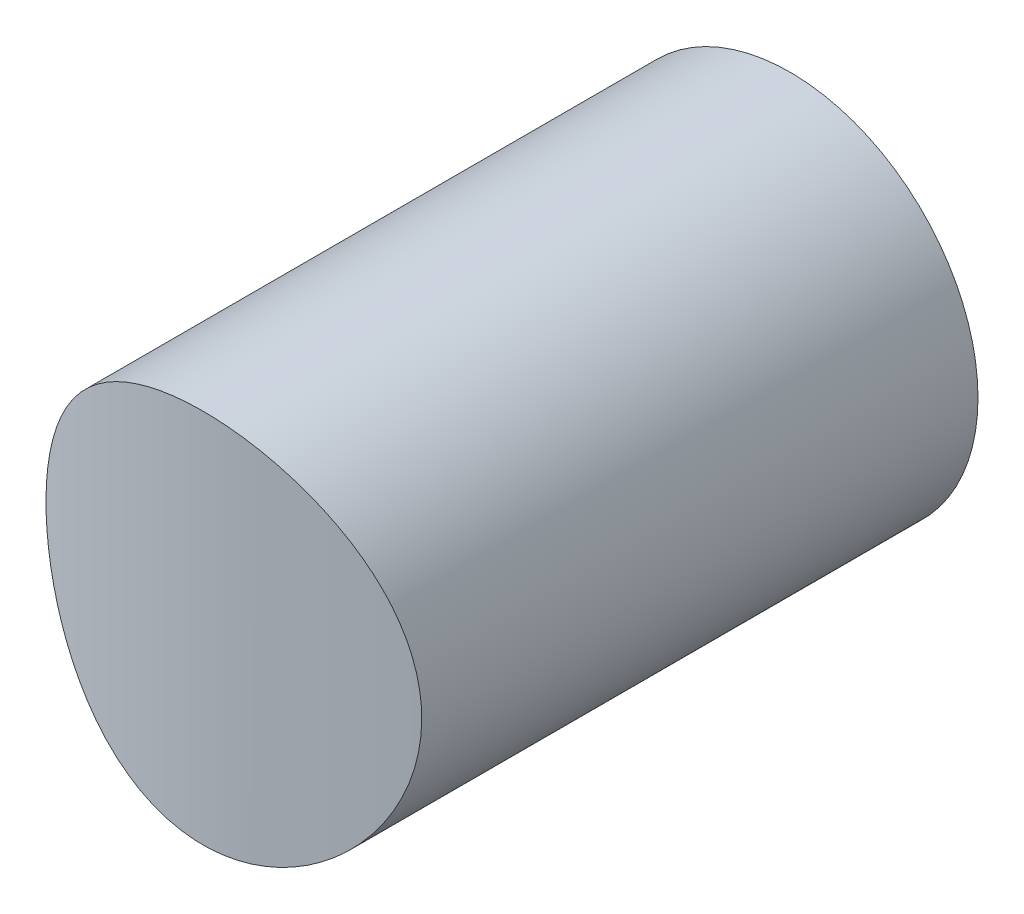
ISO-10303-21;
HEADER;
FILE_DESCRIPTION(('STEP AP214'),'2;1');
FILE_NAME('part.step','',(''),(''),'','','');
FILE_SCHEMA(('AUTOMOTIVE_DESIGN { 1 0 10303 214 1 1 1 1 }'));
ENDSEC;
DATA;
#1=APPLICATION_CONTEXT('core data for automotive mechanical design processes');
#2=APPLICATION_PROTOCOL_DEFINITION('international standard','automotive_design',2000,#1);
#3=PRODUCT_CONTEXT('',#1,'mechanical');
#4=PRODUCT('Part','Part','',(#3));
#5=PRODUCT_RELATED_PRODUCT_CATEGORY('part','',(#4));
#6=PRODUCT_DEFINITION_FORMATION('','',#4);
#7=PRODUCT_DEFINITION_CONTEXT('part definition',#1,'design');
#8=PRODUCT_DEFINITION('design','',#6,#7);
#9=PRODUCT_DEFINITION_SHAPE('','',#8);
#10=(LENGTH_UNIT() NAMED_UNIT(*) SI_UNIT(.MILLI.,.METRE.));
#11=(NAMED_UNIT(*) PLANE_ANGLE_UNIT() SI_UNIT($,.RADIAN.));
#12=(NAMED_UNIT(*) SI_UNIT($,.STERADIAN.) SOLID_ANGLE_UNIT());
#13=UNCERTAINTY_MEASURE_WITH_UNIT(LENGTH_MEASURE(1.E-05),#10,'distance_accuracy_value','');
#14=(GEOMETRIC_REPRESENTATION_CONTEXT(3) GLOBAL_UNCERTAINTY_ASSIGNED_CONTEXT((#13)) GLOBAL_UNIT_ASSIGNED_CONTEXT((#10,
#11,#12)) REPRESENTATION_CONTEXT('',''));
#15=CARTESIAN_POINT('',(0.,0.,0.));
#16=DIRECTION('',(0.,0.,1.));
#17=DIRECTION('',(1.,0.,0.));
#18=AXIS2_PLACEMENT_3D('',#15,#16,#17);
#19=CARTESIAN_POINT('',(0.,50.8,0.));
#20=DIRECTION('',(0.,-1.,0.));
#21=DIRECTION('',(0.,0.,-1.));
#22=AXIS2_PLACEMENT_3D('',#19,#20,#21);
#23=CYLINDRICAL_SURFACE('',#22,50.8);
#24=CARTESIAN_POINT('',(16.256,25.4,48.128811163377));
#25=CARTESIAN_POINT('',(16.2559997151024,24.9561713135289,48.1288113924234));
#26=CARTESIAN_POINT('',(16.2378083851564,24.5123378170694,48.1349670982075));
#27=CARTESIAN_POINT('',(16.1652196336468,23.6279781391114,48.1593929403128));
#28=CARTESIAN_POINT('',(16.1108216671086,23.1874520074956,48.1776632589806));
#29=CARTESIAN_POINT('',(15.9663257320639,22.3128537804768,48.2257423589022));
#30=CARTESIAN_POINT('',(15.8762208590951,21.8787829501547,48.2555533716954));
#31=CARTESIAN_POINT('',(15.661137681709,21.0202575974212,48.3257854897898));
#32=CARTESIAN_POINT('',(15.5361592905212,20.5958030989395,48.3662066214905));
#33=CARTESIAN_POINT('',(15.252677586498,19.7601714121367,48.4563502747829));
#34=CARTESIAN_POINT('',(15.0942377133019,19.3489707726081,48.506055174944));
#35=CARTESIAN_POINT('',(14.7449655711084,18.5416492518996,48.6133658867338));
#36=CARTESIAN_POINT('',(14.5541333511084,18.1455283479107,48.6709716864113));
#37=CARTESIAN_POINT('',(14.1414671210469,17.3707333152569,48.7924702479691));
#38=CARTESIAN_POINT('',(13.9196292208441,16.9920613837742,48.8563637984467));
#39=CARTESIAN_POINT('',(13.4464836416307,16.2544201427049,48.9886967146693));
#40=CARTESIAN_POINT('',(13.1951742480652,15.8954519812042,49.0571363447897));
#41=CARTESIAN_POINT('',(12.656025585119,15.1879099858441,49.1990367231439));
#42=CARTESIAN_POINT('',(12.367260878603,14.8400592689026,49.2725884701456));
#43=CARTESIAN_POINT('',(11.7618838103605,14.1697016186088,49.420594559784));
#44=CARTESIAN_POINT('',(11.445270908385,13.84719517716,49.495048919907));
#45=CARTESIAN_POINT('',(10.7861075376323,13.2294838834434,49.6428641729163));
#46=CARTESIAN_POINT('',(10.4435529308407,12.934283403559,49.7162248891101));
#47=CARTESIAN_POINT('',(9.7346548405273,12.3731671920427,49.8598763156833));
#48=CARTESIAN_POINT('',(9.36831206115078,12.1072505942169,49.9301671168313));
#49=CARTESIAN_POINT('',(8.60504838544576,11.6005258963233,50.0674248360775));
#50=CARTESIAN_POINT('',(8.2076057489821,11.3604703100055,50.1342720695216));
#51=CARTESIAN_POINT('',(7.39274995054897,10.9148202953662,50.2608916688171));
#52=CARTESIAN_POINT('',(6.97533637688993,10.7092265778506,50.3206638887327));
#53=CARTESIAN_POINT('',(6.12350622244352,10.3342536897456,50.4314096522583));
#54=CARTESIAN_POINT('',(5.68909290902608,10.1648676000602,50.4823848765707));
#55=CARTESIAN_POINT('',(4.80634406896904,9.863782955322,50.5740637184857));
#56=CARTESIAN_POINT('',(4.35800908894506,9.73208292264536,50.6147677388022));
#57=CARTESIAN_POINT('',(3.4654579933816,9.51124213396007,50.6835717216323));
#58=CARTESIAN_POINT('',(3.02157558168956,9.42086548680435,50.7120359271693));
#59=CARTESIAN_POINT('',(2.12723666128866,9.27742308705497,50.7574162862327));
#60=CARTESIAN_POINT('',(1.67678028133487,9.2243566047179,50.7743326656208));
#61=CARTESIAN_POINT('',(0.772810571221675,9.15605597249054,50.7961330450653));
#62=CARTESIAN_POINT('',(0.319297887273099,9.14081406213848,50.8010195132951));
#63=CARTESIAN_POINT('',(-0.587377341095775,9.14829118845607,50.7986268119117));
#64=CARTESIAN_POINT('',(-1.04053989271784,9.17100942235279,50.7913478995694));
#65=CARTESIAN_POINT('',(-1.92666147981287,9.25267009305167,50.7653159897355));
#66=CARTESIAN_POINT('',(-2.35975755516148,9.31026998755278,50.7469883538956));
#67=CARTESIAN_POINT('',(-3.2193360568795,9.45999603808497,50.6997154588374));
#68=CARTESIAN_POINT('',(-3.64581867108792,9.55212121163359,50.6707705017557));
#69=CARTESIAN_POINT('',(-4.489279665876,9.77010378670397,50.6030176920961));
#70=CARTESIAN_POINT('',(-4.90625769254133,9.89596244211191,50.5642094728997));
#71=CARTESIAN_POINT('',(-5.72796136129432,10.1803735655269,50.4777292709526));
#72=CARTESIAN_POINT('',(-6.13268674692503,10.3389267173125,50.4300571028218));
#73=CARTESIAN_POINT('',(-6.93232224010545,10.6896824202687,50.3264095173236));
#74=CARTESIAN_POINT('',(-7.32704548251711,10.8822822069853,50.2703374246762));
#75=CARTESIAN_POINT('',(-8.09888086043807,11.2983023471704,50.1517756603534));
#76=CARTESIAN_POINT('',(-8.47599292974113,11.5217228164917,50.0892859645549));
#77=CARTESIAN_POINT('',(-9.21044957367794,11.9978832056653,49.9594509172671));
#78=CARTESIAN_POINT('',(-9.56779011935777,12.2506290690573,49.8921045825065));
#79=CARTESIAN_POINT('',(-10.2605776135252,12.78377415828,49.7542492547535));
#80=CARTESIAN_POINT('',(-10.5960233578008,13.0641749030005,49.683740088165));
#81=CARTESIAN_POINT('',(-11.2572136905938,13.6637139224579,49.5382143373837));
#82=CARTESIAN_POINT('',(-11.5818971069184,13.9840083182676,49.4631352873477));
#83=CARTESIAN_POINT('',(-12.2032811562489,14.6508063906055,49.313508181603));
#84=CARTESIAN_POINT('',(-12.4999809656707,14.99731083798,49.2389601415821));
#85=CARTESIAN_POINT('',(-13.0635069582743,15.7144281828981,49.0924594819785));
#86=CARTESIAN_POINT('',(-13.3303284741291,16.0850448327839,49.0205072690799));
#87=CARTESIAN_POINT('',(-13.8321948579017,16.8480172583977,48.8812665976937));
#88=CARTESIAN_POINT('',(-14.0672410939352,17.2403720971407,48.8139779384731));
#89=CARTESIAN_POINT('',(-14.5065214135615,18.049300004344,48.6852533650305));
#90=CARTESIAN_POINT('',(-14.7103406703151,18.466111707985,48.6238996765513));
#91=CARTESIAN_POINT('',(-15.0819725372181,19.3166605631916,48.5099156183802));
#92=CARTESIAN_POINT('',(-15.2497846702098,19.7503979389621,48.4572853642911));
#93=CARTESIAN_POINT('',(-15.5478545857209,20.6315619244317,48.3624720008551));
#94=CARTESIAN_POINT('',(-15.6781240754762,21.0789842184026,48.3202856352829));
#95=CARTESIAN_POINT('',(-15.8999204282583,21.9842690930481,48.2477582785035));
#96=CARTESIAN_POINT('',(-15.9914491033021,22.4421311843681,48.2174167332859));
#97=CARTESIAN_POINT('',(-16.1318279476175,23.3453247809485,48.1706275584899));
#98=CARTESIAN_POINT('',(-16.1823074904815,23.7903761363014,48.1536504474737));
#99=CARTESIAN_POINT('',(-16.2463670377162,24.6834225944239,48.1320757447049));
#100=CARTESIAN_POINT('',(-16.2599480718506,25.131417614692,48.1274778074745));
#101=CARTESIAN_POINT('',(-16.2500775234547,26.0268836480788,48.1308113721793));
#102=CARTESIAN_POINT('',(-16.2266313927819,26.4743547286345,48.1387410295591));
#103=CARTESIAN_POINT('',(-16.1429491035993,27.3654483058416,48.1668676259481));
#104=CARTESIAN_POINT('',(-16.0827133332653,27.8090708430499,48.1870644355238));
#105=CARTESIAN_POINT('',(-15.9284578203904,28.6755799216243,48.238269009456));
#106=CARTESIAN_POINT('',(-15.8355380295001,29.0986838941455,48.2689239092314));
#107=CARTESIAN_POINT('',(-15.6165071857593,29.93533066604,48.3402312044718));
#108=CARTESIAN_POINT('',(-15.490396979764,30.3488737090681,48.380883344855));
#109=CARTESIAN_POINT('',(-15.20600054186,31.1637974423995,48.4710199879607));
#110=CARTESIAN_POINT('',(-15.0477103338329,31.5651766227033,48.5205055820407));
#111=CARTESIAN_POINT('',(-14.7001701218132,32.3532742156204,48.6269267484012));
#112=CARTESIAN_POINT('',(-14.5109191588362,32.7399921736571,48.6838625514349));
#113=CARTESIAN_POINT('',(-14.0967192063816,33.5077693044692,48.8054346361224));
#114=CARTESIAN_POINT('',(-13.8708753295595,33.8883174246382,48.8702496805616));
#115=CARTESIAN_POINT('',(-13.3893472101938,34.6291996441708,49.0043653484854));
#116=CARTESIAN_POINT('',(-13.1336625175189,34.9895334384915,49.0736660396263));
#117=CARTESIAN_POINT('',(-12.5940448112225,35.6879719285523,49.2149145567029));
#118=CARTESIAN_POINT('',(-12.310105126888,36.026071343543,49.2868630052081));
#119=CARTESIAN_POINT('',(-11.7157663610096,36.6779840628759,49.4315116737751));
#120=CARTESIAN_POINT('',(-11.4053667347477,36.9917968669876,49.5042119092864));
#121=CARTESIAN_POINT('',(-10.7457824992682,37.6064615585056,49.6516592969067));
#122=CARTESIAN_POINT('',(-10.3954942453337,37.9061425199675,49.7263565039625));
#123=CARTESIAN_POINT('',(-9.67029555426186,38.4749877075817,49.8724591502311));
#124=CARTESIAN_POINT('',(-9.29538434472296,38.7441509756967,49.9438644860611));
#125=CARTESIAN_POINT('',(-8.52334691537726,39.2500204639019,50.0813964051691));
#126=CARTESIAN_POINT('',(-8.12622098824203,39.4867271114556,50.1475230579644));
#127=CARTESIAN_POINT('',(-7.31236954850217,39.925858689889,50.2726438520779));
#128=CARTESIAN_POINT('',(-6.89564444114848,40.1282843291969,50.3316381407817));
#129=CARTESIAN_POINT('',(-6.04848523934352,40.4958612891555,50.4404290033421));
#130=CARTESIAN_POINT('',(-5.61817030768499,40.6612684920763,50.4902882567383));
#131=CARTESIAN_POINT('',(-4.74408136368394,40.9551862731826,50.5799038886203));
#132=CARTESIAN_POINT('',(-4.30030734813089,41.0836968425667,50.6196602646961));
#133=CARTESIAN_POINT('',(-3.40272459045617,41.3025888362617,50.6879075630437));
#134=CARTESIAN_POINT('',(-2.94891862547641,41.3929806772401,50.7164015628403));
#135=CARTESIAN_POINT('',(-2.03467140505109,41.534795069135,50.7612995857911));
#136=CARTESIAN_POINT('',(-1.57423040916671,41.586219140269,50.7777040805824));
#137=CARTESIAN_POINT('',(-0.670511061868287,41.6482021567535,50.7974973089933));
#138=CARTESIAN_POINT('',(-0.227359041149252,41.6604440246068,50.8014220137314));
#139=CARTESIAN_POINT('',(0.658406678886367,41.6486984115576,50.7976636019136));
#140=CARTESIAN_POINT('',(1.10102039443263,41.6247120514546,50.78998084446));
#141=CARTESIAN_POINT('',(1.98243339524551,41.540739540152,50.7632185770711));
#142=CARTESIAN_POINT('',(2.42123295319698,41.4807559843291,50.7441398887763));
#143=CARTESIAN_POINT('',(3.29188762303116,41.3253433919072,50.6951042590474));
#144=CARTESIAN_POINT('',(3.72374271249802,41.2299142409183,50.6651472825069));
#145=CARTESIAN_POINT('',(4.5716212603015,41.0060065639227,50.5956396501645));
#146=CARTESIAN_POINT('',(4.98778060009749,40.8779991093648,50.5562261625026));
#147=CARTESIAN_POINT('',(5.80766778240668,40.5893848387421,50.4686138236148));
#148=CARTESIAN_POINT('',(6.21139580101626,40.4287784847032,50.4204150969035));
#149=CARTESIAN_POINT('',(7.00394126073575,40.0761876043953,50.3164444255998));
#150=CARTESIAN_POINT('',(7.39275700551886,39.8841995213313,50.2606716226853));
#151=CARTESIAN_POINT('',(8.15312047669992,39.4702368644591,50.1429423228172));
#152=CARTESIAN_POINT('',(8.52466713184609,39.2482604337146,50.0809854429957));
#153=CARTESIAN_POINT('',(9.2610109221832,38.7675443281604,49.9501588181261));
#154=CARTESIAN_POINT('',(9.6251159611744,38.5077893957156,49.8811229635299));
#155=CARTESIAN_POINT('',(10.3303229133609,37.9595167217031,49.7398610675802));
#156=CARTESIAN_POINT('',(10.6714243415827,37.6709983740483,49.6676349590213));
#157=CARTESIAN_POINT('',(11.3286871627907,37.0669471897174,49.5218558845945));
#158=CARTESIAN_POINT('',(11.6448412135303,36.7514064566565,49.4483025358752));
#159=CARTESIAN_POINT('',(12.2501832886483,36.095315477458,49.3018255858266));
#160=CARTESIAN_POINT('',(12.5393716197317,35.754765515851,49.2289019773433));
#161=CARTESIAN_POINT('',(13.0986895742645,35.0382385036035,49.0831009530922));
#162=CARTESIAN_POINT('',(13.3677861357191,34.661435251389,49.0103160287439));
#163=CARTESIAN_POINT('',(13.8732405334457,33.8855816813223,48.869643442099));
#164=CARTESIAN_POINT('',(14.109597133979,33.486530524541,48.8017559646982));
#165=CARTESIAN_POINT('',(14.5476919641103,32.6689221086521,48.6729575846973));
#166=CARTESIAN_POINT('',(14.7494403252081,32.2503706040189,48.612044642057));
#167=CARTESIAN_POINT('',(15.1167190003797,31.3965228392973,48.4990902866495));
#168=CARTESIAN_POINT('',(15.2822519462237,30.9612277986647,48.4470482292967));
#169=CARTESIAN_POINT('',(15.5651798728285,30.1084941877648,48.3568570163709));
#170=CARTESIAN_POINT('',(15.685162129302,29.6919891651628,48.317982771007));
#171=CARTESIAN_POINT('',(15.8916107257509,28.8499459975329,48.2504769664395));
#172=CARTESIAN_POINT('',(15.9780789562082,28.4244083634514,48.2218448294992));
#173=CARTESIAN_POINT('',(16.1167253158915,27.5672852664731,48.1756838666734));
#174=CARTESIAN_POINT('',(16.1689115054348,27.1357012495785,48.1581524308508));
#175=CARTESIAN_POINT('',(16.2385494154985,26.269413077715,48.1347158236099));
#176=CARTESIAN_POINT('',(16.2560002790435,25.834708846031,48.128810939037));
#177=CARTESIAN_POINT('',(16.256,25.4,48.128811163377));
#178=B_SPLINE_CURVE_WITH_KNOTS('',3,(#24,#25,#26,#27,#28,#29,#30,#31,#32,#33,#34,#35,#36,#37,
#38,#39,#40,#41,#42,#43,#44,#45,#46,#47,#48,#49,#50,#51,#52,#53,#54,#55,#56,#57,#58,#59,#60,#61,
#62,#63,#64,#65,#66,#67,#68,#69,#70,#71,#72,#73,#74,#75,#76,#77,#78,#79,#80,#81,#82,#83,#84,#85,
#86,#87,#88,#89,#90,#91,#92,#93,#94,#95,#96,#97,#98,#99,#100,#101,#102,#103,#104,#105,#106,#107,
#108,#109,#110,#111,#112,#113,#114,#115,#116,#117,#118,#119,#120,#121,#122,#123,#124,#125,#126,
#127,#128,#129,#130,#131,#132,#133,#134,#135,#136,#137,#138,#139,#140,#141,#142,#143,#144,#145,
#146,#147,#148,#149,#150,#151,#152,#153,#154,#155,#156,#157,#158,#159,#160,#161,#162,#163,#164,
#165,#166,#167,#168,#169,#170,#171,#172,#173,#174,#175,#176,#177),.UNSPECIFIED.,.T.,.F.,(4,2,2,
2,2,2,2,2,2,2,2,2,2,2,2,2,2,2,2,2,2,2,2,2,2,2,2,2,2,2,2,2,2,2,2,2,2,2,2,2,2,2,2,2,2,2,2,2,2,2,2,
2,2,2,2,2,2,2,2,2,2,2,2,2,2,2,2,2,2,2,2,2,2,2,2,2,4),(0.,1.33108116098077,2.66218235756336,
3.99354106808043,5.32490309124726,6.65376328709602,7.9826214728916,9.3116465343748,
10.6407489525715,12.0132887386818,13.3858551576449,14.7586409805236,16.1313861865667,
17.5369591093682,18.9425610197557,20.3478940860699,21.7531720434579,23.1131161421033,
24.4730336410844,25.8326721029195,27.1922818117775,28.5026214017392,29.8129237063272,
31.1232747220997,32.4336531455652,33.7604727595652,35.0872973611188,36.4143913488356,
37.7415582652012,39.1266078124899,40.5116981103872,41.8970044740901,43.2822511730752,
44.6845468998499,46.0868612083619,47.4887377471416,48.8905487089588,50.2335503899057,
51.5765145899789,52.9192810712464,54.2620333849268,55.5633478838937,56.8646291829682,
58.1660713644564,59.4675538646915,60.8077751761284,62.1480167066367,63.4885754084922,
64.8291617144444,66.2285056845439,67.6278935718797,69.027263027082,70.4266035603253,
71.8159502295028,73.2052972300958,74.5942643187839,75.9831772180559,77.3115732890545,
78.639928264055,79.9681874769427,81.2964509764181,82.606502968002,83.9165363934479,
85.2267184007478,86.5369815742656,87.8931326846048,89.2493123770651,90.6058897286632,
91.9624516488333,93.3668979685748,94.7713972833769,96.1754847292367,97.579470106302,
98.8835481784686,100.187552678609,101.491250474274,102.794980433832),.UNSPECIFIED.);
#179=CARTESIAN_POINT('',(16.256,25.4,48.128811163377));
#180=VERTEX_POINT('',#179);
#181=EDGE_CURVE('E10',#180,#180,#178,.T.);
#182=ORIENTED_EDGE('',*,*,#181,.F.);
#183=EDGE_LOOP('',(#182));
#184=FACE_BOUND('',#183,.T.);
#185=ADVANCED_FACE('F36',(#184),#23,.T.);
#186=CARTESIAN_POINT('',(0.,25.4,-50.8));
#187=DIRECTION('',(0.,0.,1.));
#188=DIRECTION('',(1.,0.,0.));
#189=AXIS2_PLACEMENT_3D('',#186,#187,#188);
#190=CYLINDRICAL_SURFACE('',#189,16.256);
#191=CARTESIAN_POINT('',(0.,25.4,0.));
#192=DIRECTION('',(0.,0.,1.));
#193=DIRECTION('',(1.,0.,0.));
#194=AXIS2_PLACEMENT_3D('',#191,#192,#193);
#195=CIRCLE('',#194,16.256);
#196=CARTESIAN_POINT('',(16.256,25.4,0.));
#197=VERTEX_POINT('',#196);
#198=EDGE_CURVE('E46',#197,#197,#195,.T.);
#199=ORIENTED_EDGE('',*,*,#198,.T.);
#200=EDGE_LOOP('',(#199));
#201=FACE_BOUND('',#200,.T.);
#202=ORIENTED_EDGE('',*,*,#181,.T.);
#203=EDGE_LOOP('',(#202));
#204=FACE_BOUND('',#203,.T.);
#205=ADVANCED_FACE('F52',(#201,#204),#190,.T.);
#206=CARTESIAN_POINT('',(0.,25.4,0.));
#207=DIRECTION('',(0.,0.,1.));
#208=DIRECTION('',(1.,0.,0.));
#209=AXIS2_PLACEMENT_3D('',#206,#207,#208);
#210=PLANE('',#209);
#211=ORIENTED_EDGE('',*,*,#198,.F.);
#212=EDGE_LOOP('',(#211));
#213=FACE_BOUND('',#212,.T.);
#214=ADVANCED_FACE('F54',(#213),#210,.F.);
#215=CLOSED_SHELL('',(#185,#205,#214));
#216=MANIFOLD_SOLID_BREP('B2',#215);
#217=ADVANCED_BREP_SHAPE_REPRESENTATION('',(#18,#216),#14);
#218=SHAPE_DEFINITION_REPRESENTATION(#9,#217);
ENDSEC;
END-ISO-10303-21;
